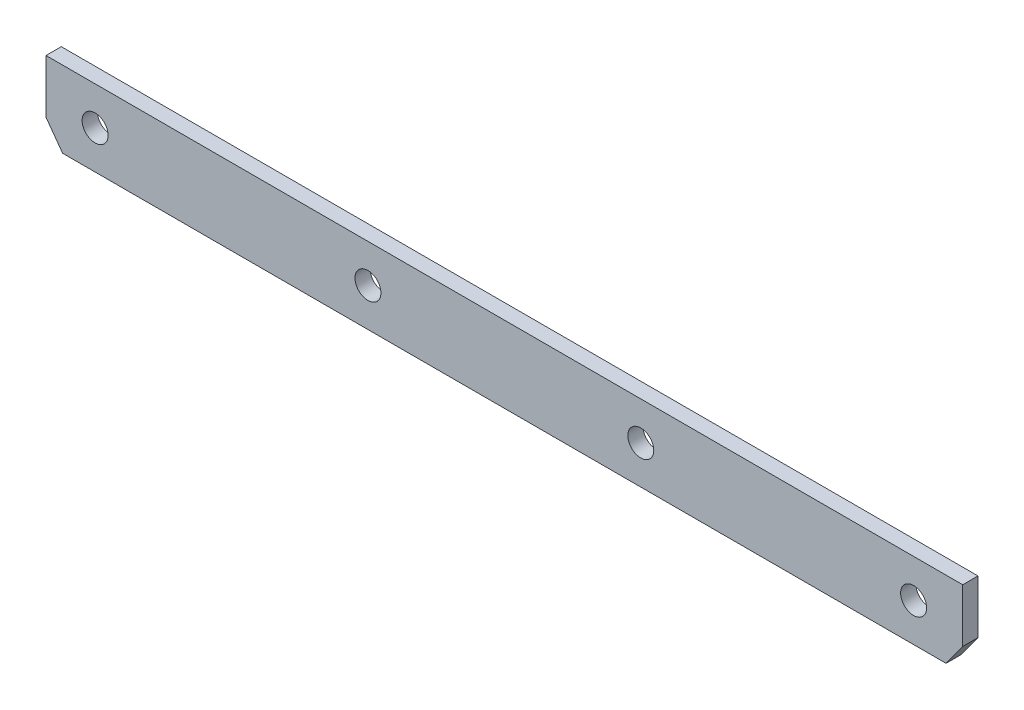
ISO-10303-21;
HEADER;
FILE_DESCRIPTION(('STEP AP214'),'2;1');
FILE_NAME('part.step','',(''),(''),'','','');
FILE_SCHEMA(('AUTOMOTIVE_DESIGN { 1 0 10303 214 1 1 1 1 }'));
ENDSEC;
DATA;
#1=APPLICATION_CONTEXT('core data for automotive mechanical design processes');
#2=APPLICATION_PROTOCOL_DEFINITION('international standard','automotive_design',2000,#1);
#3=PRODUCT_CONTEXT('',#1,'mechanical');
#4=PRODUCT('Part','Part','',(#3));
#5=PRODUCT_RELATED_PRODUCT_CATEGORY('part','',(#4));
#6=PRODUCT_DEFINITION_FORMATION('','',#4);
#7=PRODUCT_DEFINITION_CONTEXT('part definition',#1,'design');
#8=PRODUCT_DEFINITION('design','',#6,#7);
#9=PRODUCT_DEFINITION_SHAPE('','',#8);
#10=(LENGTH_UNIT() NAMED_UNIT(*) SI_UNIT(.MILLI.,.METRE.));
#11=(NAMED_UNIT(*) PLANE_ANGLE_UNIT() SI_UNIT($,.RADIAN.));
#12=(NAMED_UNIT(*) SI_UNIT($,.STERADIAN.) SOLID_ANGLE_UNIT());
#13=UNCERTAINTY_MEASURE_WITH_UNIT(LENGTH_MEASURE(1.E-05),#10,'distance_accuracy_value','');
#14=(GEOMETRIC_REPRESENTATION_CONTEXT(3) GLOBAL_UNCERTAINTY_ASSIGNED_CONTEXT((#13)) GLOBAL_UNIT_ASSIGNED_CONTEXT((#10,
#11,#12)) REPRESENTATION_CONTEXT('',''));
#15=CARTESIAN_POINT('',(0.,0.,0.));
#16=DIRECTION('',(0.,0.,1.));
#17=DIRECTION('',(1.,0.,0.));
#18=AXIS2_PLACEMENT_3D('',#15,#16,#17);
#19=CARTESIAN_POINT('',(135.,-4.99999999999998,2.));
#20=DIRECTION('',(0.,1.,0.));
#21=DIRECTION('',(-1.,0.,0.));
#22=AXIS2_PLACEMENT_3D('',#19,#20,#21);
#23=PLANE('',#22);
#24=DIRECTION('',(0.,0.,-1.));
#25=VECTOR('',#24,1.);
#26=CARTESIAN_POINT('',(-57.820372415984,-4.99999999999933,10.));
#27=LINE('',#26,#25);
#28=CARTESIAN_POINT('',(-57.820372415984,-4.99999999999933,2.));
#29=VERTEX_POINT('',#28);
#30=CARTESIAN_POINT('',(-57.820372415984,-4.99999999999933,0.));
#31=VERTEX_POINT('',#30);
#32=EDGE_CURVE('E130',#29,#31,#27,.T.);
#33=ORIENTED_EDGE('',*,*,#32,.T.);
#34=DIRECTION('',(1.,0.,0.));
#35=VECTOR('',#34,1.);
#36=CARTESIAN_POINT('',(135.,-4.99999999999998,0.));
#37=LINE('',#36,#35);
#38=CARTESIAN_POINT('',(57.8203724159839,-4.99999999999999,0.));
#39=VERTEX_POINT('',#38);
#40=EDGE_CURVE('E140',#31,#39,#37,.T.);
#41=ORIENTED_EDGE('',*,*,#40,.T.);
#42=DIRECTION('',(0.,0.,-1.));
#43=VECTOR('',#42,1.);
#44=CARTESIAN_POINT('',(57.8203724159839,-4.99999999999997,10.));
#45=LINE('',#44,#43);
#46=CARTESIAN_POINT('',(57.8203724159839,-4.99999999999997,2.));
#47=VERTEX_POINT('',#46);
#48=EDGE_CURVE('E96',#47,#39,#45,.T.);
#49=ORIENTED_EDGE('',*,*,#48,.F.);
#50=DIRECTION('',(1.,0.,0.));
#51=VECTOR('',#50,1.);
#52=CARTESIAN_POINT('',(135.,-4.99999999999998,2.));
#53=LINE('',#52,#51);
#54=EDGE_CURVE('E142',#29,#47,#53,.T.);
#55=ORIENTED_EDGE('',*,*,#54,.F.);
#56=EDGE_LOOP('',(#33,#41,#49,#55));
#57=FACE_BOUND('',#56,.T.);
#58=ADVANCED_FACE('F73',(#57),#23,.F.);
#59=CARTESIAN_POINT('',(135.,5.00000000000002,2.));
#60=DIRECTION('',(0.,-1.,0.));
#61=DIRECTION('',(1.,0.,0.));
#62=AXIS2_PLACEMENT_3D('',#59,#60,#61);
#63=PLANE('',#62);
#64=DIRECTION('',(0.,0.,-1.));
#65=VECTOR('',#64,1.);
#66=CARTESIAN_POINT('',(60.,5.00000000000001,10.));
#67=LINE('',#66,#65);
#68=CARTESIAN_POINT('',(60.,5.00000000000001,2.));
#69=VERTEX_POINT('',#68);
#70=CARTESIAN_POINT('',(60.,5.00000000000001,0.));
#71=VERTEX_POINT('',#70);
#72=EDGE_CURVE('E203',#69,#71,#67,.T.);
#73=ORIENTED_EDGE('',*,*,#72,.T.);
#74=DIRECTION('',(-1.,0.,0.));
#75=VECTOR('',#74,1.);
#76=CARTESIAN_POINT('',(135.,5.00000000000002,0.));
#77=LINE('',#76,#75);
#78=CARTESIAN_POINT('',(-60.,5.00000000000067,0.));
#79=VERTEX_POINT('',#78);
#80=EDGE_CURVE('E146',#71,#79,#77,.T.);
#81=ORIENTED_EDGE('',*,*,#80,.T.);
#82=DIRECTION('',(0.,0.,-1.));
#83=VECTOR('',#82,1.);
#84=CARTESIAN_POINT('',(-60.,5.00000000000067,10.));
#85=LINE('',#84,#83);
#86=CARTESIAN_POINT('',(-60.,5.00000000000067,2.));
#87=VERTEX_POINT('',#86);
#88=EDGE_CURVE('E208',#87,#79,#85,.T.);
#89=ORIENTED_EDGE('',*,*,#88,.F.);
#90=DIRECTION('',(-1.,0.,0.));
#91=VECTOR('',#90,1.);
#92=CARTESIAN_POINT('',(135.,5.00000000000002,2.));
#93=LINE('',#92,#91);
#94=EDGE_CURVE('E155',#69,#87,#93,.T.);
#95=ORIENTED_EDGE('',*,*,#94,.F.);
#96=EDGE_LOOP('',(#73,#81,#89,#95));
#97=FACE_BOUND('',#96,.T.);
#98=ADVANCED_FACE('F187',(#97),#63,.F.);
#99=CARTESIAN_POINT('',(0.,0.,2.));
#100=DIRECTION('',(0.,0.,1.));
#101=DIRECTION('',(1.,0.,0.));
#102=AXIS2_PLACEMENT_3D('',#99,#100,#101);
#103=PLANE('',#102);
#104=CARTESIAN_POINT('',(53.5714285714285,0.,2.));
#105=DIRECTION('',(0.,0.,1.));
#106=DIRECTION('',(1.,0.,0.));
#107=AXIS2_PLACEMENT_3D('',#104,#105,#106);
#108=CIRCLE('',#107,1.70000000000001);
#109=CARTESIAN_POINT('',(55.2714285714285,0.,2.));
#110=VERTEX_POINT('',#109);
#111=EDGE_CURVE('E161',#110,#110,#108,.T.);
#112=ORIENTED_EDGE('',*,*,#111,.F.);
#113=EDGE_LOOP('',(#112));
#114=FACE_BOUND('',#113,.T.);
#115=CARTESIAN_POINT('',(17.8571428571428,0.,2.));
#116=DIRECTION('',(0.,0.,1.));
#117=DIRECTION('',(1.,0.,0.));
#118=AXIS2_PLACEMENT_3D('',#115,#116,#117);
#119=CIRCLE('',#118,1.70000000000001);
#120=CARTESIAN_POINT('',(19.5571428571428,0.,2.));
#121=VERTEX_POINT('',#120);
#122=EDGE_CURVE('E167',#121,#121,#119,.T.);
#123=ORIENTED_EDGE('',*,*,#122,.F.);
#124=EDGE_LOOP('',(#123));
#125=FACE_BOUND('',#124,.T.);
#126=CARTESIAN_POINT('',(-17.8571428571429,0.,2.));
#127=DIRECTION('',(0.,0.,1.));
#128=DIRECTION('',(1.,0.,0.));
#129=AXIS2_PLACEMENT_3D('',#126,#127,#128);
#130=CIRCLE('',#129,1.70000000000001);
#131=CARTESIAN_POINT('',(-16.1571428571429,0.,2.));
#132=VERTEX_POINT('',#131);
#133=EDGE_CURVE('E173',#132,#132,#130,.T.);
#134=ORIENTED_EDGE('',*,*,#133,.F.);
#135=EDGE_LOOP('',(#134));
#136=FACE_BOUND('',#135,.T.);
#137=CARTESIAN_POINT('',(-53.5714285714286,0.,2.));
#138=DIRECTION('',(0.,0.,1.));
#139=DIRECTION('',(1.,0.,0.));
#140=AXIS2_PLACEMENT_3D('',#137,#138,#139);
#141=CIRCLE('',#140,1.70000000000001);
#142=CARTESIAN_POINT('',(-51.8714285714286,0.,2.));
#143=VERTEX_POINT('',#142);
#144=EDGE_CURVE('E12',#143,#143,#141,.T.);
#145=ORIENTED_EDGE('',*,*,#144,.F.);
#146=EDGE_LOOP('',(#145));
#147=FACE_BOUND('',#146,.T.);
#148=ORIENTED_EDGE('',*,*,#94,.T.);
#149=DIRECTION('',(0.,-1.,0.));
#150=VECTOR('',#149,1.);
#151=CARTESIAN_POINT('',(-60.0000000000001,7.13714801544747E-13,2.));
#152=LINE('',#151,#150);
#153=CARTESIAN_POINT('',(-60.0000000000001,-1.99999999999931,2.));
#154=VERTEX_POINT('',#153);
#155=EDGE_CURVE('E152',#87,#154,#152,.T.);
#156=ORIENTED_EDGE('',*,*,#155,.T.);
#157=DIRECTION('',(0.587785252292466,-0.809016994374952,0.));
#158=VECTOR('',#157,1.);
#159=CARTESIAN_POINT('',(-40.2215663475438,-29.2226784944793,2.));
#160=LINE('',#159,#158);
#161=EDGE_CURVE('E199',#154,#29,#160,.T.);
#162=ORIENTED_EDGE('',*,*,#161,.T.);
#163=ORIENTED_EDGE('',*,*,#54,.T.);
#164=DIRECTION('',(0.587785252292474,0.809016994374947,0.));
#165=VECTOR('',#164,1.);
#166=CARTESIAN_POINT('',(40.2215663475435,-29.2226784944797,2.));
#167=LINE('',#166,#165);
#168=CARTESIAN_POINT('',(60.,-1.99999999999997,2.));
#169=VERTEX_POINT('',#168);
#170=EDGE_CURVE('E201',#47,#169,#167,.T.);
#171=ORIENTED_EDGE('',*,*,#170,.T.);
#172=DIRECTION('',(0.,1.,0.));
#173=VECTOR('',#172,1.);
#174=CARTESIAN_POINT('',(60.,0.,2.));
#175=LINE('',#174,#173);
#176=EDGE_CURVE('E147',#169,#69,#175,.T.);
#177=ORIENTED_EDGE('',*,*,#176,.T.);
#178=EDGE_LOOP('',(#148,#156,#162,#163,#171,#177));
#179=FACE_BOUND('',#178,.T.);
#180=ADVANCED_FACE('F184',(#114,#125,#136,#147,#179),#103,.T.);
#181=CARTESIAN_POINT('',(0.,0.,0.));
#182=DIRECTION('',(0.,0.,1.));
#183=DIRECTION('',(1.,0.,0.));
#184=AXIS2_PLACEMENT_3D('',#181,#182,#183);
#185=PLANE('',#184);
#186=CARTESIAN_POINT('',(53.5714285714285,0.,0.));
#187=DIRECTION('',(0.,0.,1.));
#188=DIRECTION('',(1.,0.,0.));
#189=AXIS2_PLACEMENT_3D('',#186,#187,#188);
#190=CIRCLE('',#189,1.70000000000001);
#191=CARTESIAN_POINT('',(55.2714285714285,0.,0.));
#192=VERTEX_POINT('',#191);
#193=EDGE_CURVE('E158',#192,#192,#190,.T.);
#194=ORIENTED_EDGE('',*,*,#193,.T.);
#195=EDGE_LOOP('',(#194));
#196=FACE_BOUND('',#195,.T.);
#197=CARTESIAN_POINT('',(17.8571428571428,0.,0.));
#198=DIRECTION('',(0.,0.,1.));
#199=DIRECTION('',(1.,0.,0.));
#200=AXIS2_PLACEMENT_3D('',#197,#198,#199);
#201=CIRCLE('',#200,1.70000000000001);
#202=CARTESIAN_POINT('',(19.5571428571428,0.,0.));
#203=VERTEX_POINT('',#202);
#204=EDGE_CURVE('E164',#203,#203,#201,.T.);
#205=ORIENTED_EDGE('',*,*,#204,.T.);
#206=EDGE_LOOP('',(#205));
#207=FACE_BOUND('',#206,.T.);
#208=CARTESIAN_POINT('',(-17.8571428571429,0.,0.));
#209=DIRECTION('',(0.,0.,1.));
#210=DIRECTION('',(1.,0.,0.));
#211=AXIS2_PLACEMENT_3D('',#208,#209,#210);
#212=CIRCLE('',#211,1.70000000000001);
#213=CARTESIAN_POINT('',(-16.1571428571429,0.,0.));
#214=VERTEX_POINT('',#213);
#215=EDGE_CURVE('E170',#214,#214,#212,.T.);
#216=ORIENTED_EDGE('',*,*,#215,.T.);
#217=EDGE_LOOP('',(#216));
#218=FACE_BOUND('',#217,.T.);
#219=CARTESIAN_POINT('',(-53.5714285714286,0.,0.));
#220=DIRECTION('',(0.,0.,1.));
#221=DIRECTION('',(1.,0.,0.));
#222=AXIS2_PLACEMENT_3D('',#219,#220,#221);
#223=CIRCLE('',#222,1.70000000000001);
#224=CARTESIAN_POINT('',(-51.8714285714286,0.,0.));
#225=VERTEX_POINT('',#224);
#226=EDGE_CURVE('E81',#225,#225,#223,.T.);
#227=ORIENTED_EDGE('',*,*,#226,.T.);
#228=EDGE_LOOP('',(#227));
#229=FACE_BOUND('',#228,.T.);
#230=DIRECTION('',(0.,1.,0.));
#231=VECTOR('',#230,1.);
#232=CARTESIAN_POINT('',(-60.,5.00000000000067,0.));
#233=LINE('',#232,#231);
#234=CARTESIAN_POINT('',(-60.0000000000001,-1.99999999999931,0.));
#235=VERTEX_POINT('',#234);
#236=EDGE_CURVE('E88',#235,#79,#233,.T.);
#237=ORIENTED_EDGE('',*,*,#236,.T.);
#238=ORIENTED_EDGE('',*,*,#80,.F.);
#239=DIRECTION('',(0.,-1.,0.));
#240=VECTOR('',#239,1.);
#241=CARTESIAN_POINT('',(60.,5.00000000000001,0.));
#242=LINE('',#241,#240);
#243=CARTESIAN_POINT('',(60.,-1.99999999999997,0.));
#244=VERTEX_POINT('',#243);
#245=EDGE_CURVE('E213',#71,#244,#242,.T.);
#246=ORIENTED_EDGE('',*,*,#245,.T.);
#247=DIRECTION('',(-0.587785252292474,-0.809016994374947,0.));
#248=VECTOR('',#247,1.);
#249=CARTESIAN_POINT('',(60.,-1.99999999999997,0.));
#250=LINE('',#249,#248);
#251=EDGE_CURVE('E135',#244,#39,#250,.T.);
#252=ORIENTED_EDGE('',*,*,#251,.T.);
#253=ORIENTED_EDGE('',*,*,#40,.F.);
#254=DIRECTION('',(-0.587785252292466,0.809016994374952,0.));
#255=VECTOR('',#254,1.);
#256=CARTESIAN_POINT('',(-60.0000000000001,-1.99999999999931,0.));
#257=LINE('',#256,#255);
#258=EDGE_CURVE('E127',#31,#235,#257,.T.);
#259=ORIENTED_EDGE('',*,*,#258,.T.);
#260=EDGE_LOOP('',(#237,#238,#246,#252,#253,#259));
#261=FACE_BOUND('',#260,.T.);
#262=ADVANCED_FACE('F144',(#196,#207,#218,#229,#261),#185,.F.);
#263=CARTESIAN_POINT('',(-53.5714285714286,0.,2.));
#264=DIRECTION('',(0.,0.,1.));
#265=DIRECTION('',(1.,0.,0.));
#266=AXIS2_PLACEMENT_3D('',#263,#264,#265);
#267=CYLINDRICAL_SURFACE('',#266,1.70000000000001);
#268=ORIENTED_EDGE('',*,*,#226,.F.);
#269=EDGE_LOOP('',(#268));
#270=FACE_BOUND('',#269,.T.);
#271=ORIENTED_EDGE('',*,*,#144,.T.);
#272=EDGE_LOOP('',(#271));
#273=FACE_BOUND('',#272,.T.);
#274=ADVANCED_FACE('F75',(#270,#273),#267,.F.);
#275=CARTESIAN_POINT('',(-17.8571428571429,0.,2.));
#276=DIRECTION('',(0.,0.,1.));
#277=DIRECTION('',(1.,0.,0.));
#278=AXIS2_PLACEMENT_3D('',#275,#276,#277);
#279=CYLINDRICAL_SURFACE('',#278,1.70000000000001);
#280=ORIENTED_EDGE('',*,*,#215,.F.);
#281=EDGE_LOOP('',(#280));
#282=FACE_BOUND('',#281,.T.);
#283=ORIENTED_EDGE('',*,*,#133,.T.);
#284=EDGE_LOOP('',(#283));
#285=FACE_BOUND('',#284,.T.);
#286=ADVANCED_FACE('F181',(#282,#285),#279,.F.);
#287=CARTESIAN_POINT('',(17.8571428571428,0.,2.));
#288=DIRECTION('',(0.,0.,1.));
#289=DIRECTION('',(1.,0.,0.));
#290=AXIS2_PLACEMENT_3D('',#287,#288,#289);
#291=CYLINDRICAL_SURFACE('',#290,1.70000000000001);
#292=ORIENTED_EDGE('',*,*,#204,.F.);
#293=EDGE_LOOP('',(#292));
#294=FACE_BOUND('',#293,.T.);
#295=ORIENTED_EDGE('',*,*,#122,.T.);
#296=EDGE_LOOP('',(#295));
#297=FACE_BOUND('',#296,.T.);
#298=ADVANCED_FACE('F240',(#294,#297),#291,.F.);
#299=CARTESIAN_POINT('',(53.5714285714285,0.,2.));
#300=DIRECTION('',(0.,0.,1.));
#301=DIRECTION('',(1.,0.,0.));
#302=AXIS2_PLACEMENT_3D('',#299,#300,#301);
#303=CYLINDRICAL_SURFACE('',#302,1.70000000000001);
#304=ORIENTED_EDGE('',*,*,#193,.F.);
#305=EDGE_LOOP('',(#304));
#306=FACE_BOUND('',#305,.T.);
#307=ORIENTED_EDGE('',*,*,#111,.T.);
#308=EDGE_LOOP('',(#307));
#309=FACE_BOUND('',#308,.T.);
#310=ADVANCED_FACE('F237',(#306,#309),#303,.F.);
#311=CARTESIAN_POINT('',(60.,-1.99999999999997,10.));
#312=DIRECTION('',(0.809016994374947,-0.587785252292474,0.));
#313=DIRECTION('',(0.587785252292474,0.809016994374947,0.));
#314=AXIS2_PLACEMENT_3D('',#311,#312,#313);
#315=PLANE('',#314);
#316=ORIENTED_EDGE('',*,*,#48,.T.);
#317=ORIENTED_EDGE('',*,*,#251,.F.);
#318=DIRECTION('',(0.,0.,-1.));
#319=VECTOR('',#318,1.);
#320=CARTESIAN_POINT('',(60.,-1.99999999999997,10.));
#321=LINE('',#320,#319);
#322=EDGE_CURVE('E204',#169,#244,#321,.T.);
#323=ORIENTED_EDGE('',*,*,#322,.F.);
#324=ORIENTED_EDGE('',*,*,#170,.F.);
#325=EDGE_LOOP('',(#316,#317,#323,#324));
#326=FACE_BOUND('',#325,.T.);
#327=ADVANCED_FACE('F226',(#326),#315,.T.);
#328=CARTESIAN_POINT('',(60.,5.00000000000001,10.));
#329=DIRECTION('',(1.,0.,0.));
#330=DIRECTION('',(0.,0.,-1.));
#331=AXIS2_PLACEMENT_3D('',#328,#329,#330);
#332=PLANE('',#331);
#333=ORIENTED_EDGE('',*,*,#322,.T.);
#334=ORIENTED_EDGE('',*,*,#245,.F.);
#335=ORIENTED_EDGE('',*,*,#72,.F.);
#336=ORIENTED_EDGE('',*,*,#176,.F.);
#337=EDGE_LOOP('',(#333,#334,#335,#336));
#338=FACE_BOUND('',#337,.T.);
#339=ADVANCED_FACE('F216',(#338),#332,.T.);
#340=CARTESIAN_POINT('',(-60.,5.00000000000067,10.));
#341=DIRECTION('',(-1.,0.,0.));
#342=DIRECTION('',(0.,-1.,0.));
#343=AXIS2_PLACEMENT_3D('',#340,#341,#342);
#344=PLANE('',#343);
#345=ORIENTED_EDGE('',*,*,#88,.T.);
#346=ORIENTED_EDGE('',*,*,#236,.F.);
#347=DIRECTION('',(0.,0.,-1.));
#348=VECTOR('',#347,1.);
#349=CARTESIAN_POINT('',(-60.0000000000001,-1.99999999999931,10.));
#350=LINE('',#349,#348);
#351=EDGE_CURVE('E132',#154,#235,#350,.T.);
#352=ORIENTED_EDGE('',*,*,#351,.F.);
#353=ORIENTED_EDGE('',*,*,#155,.F.);
#354=EDGE_LOOP('',(#345,#346,#352,#353));
#355=FACE_BOUND('',#354,.T.);
#356=ADVANCED_FACE('F218',(#355),#344,.T.);
#357=CARTESIAN_POINT('',(-60.0000000000001,-1.99999999999931,10.));
#358=DIRECTION('',(-0.809016994374952,-0.587785252292466,0.));
#359=DIRECTION('',(0.587785252292466,-0.809016994374952,0.));
#360=AXIS2_PLACEMENT_3D('',#357,#358,#359);
#361=PLANE('',#360);
#362=ORIENTED_EDGE('',*,*,#351,.T.);
#363=ORIENTED_EDGE('',*,*,#258,.F.);
#364=ORIENTED_EDGE('',*,*,#32,.F.);
#365=ORIENTED_EDGE('',*,*,#161,.F.);
#366=EDGE_LOOP('',(#362,#363,#364,#365));
#367=FACE_BOUND('',#366,.T.);
#368=ADVANCED_FACE('F129',(#367),#361,.T.);
#369=CLOSED_SHELL('',(#58,#98,#180,#262,#274,#286,#298,#310,#327,#339,#356,#368));
#370=MANIFOLD_SOLID_BREP('B2',#369);
#371=ADVANCED_BREP_SHAPE_REPRESENTATION('',(#18,#370),#14);
#372=SHAPE_DEFINITION_REPRESENTATION(#9,#371);
ENDSEC;
END-ISO-10303-21;
